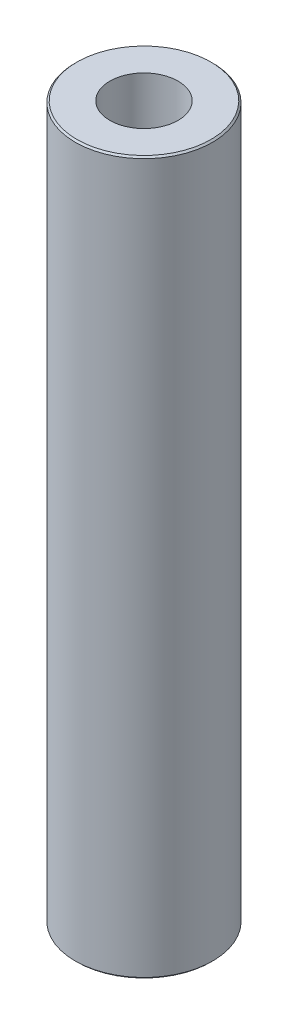
ISO-10303-21;
HEADER;
FILE_DESCRIPTION(('STEP AP214'),'2;1');
FILE_NAME('part.step','',(''),(''),'','','');
FILE_SCHEMA(('AUTOMOTIVE_DESIGN { 1 0 10303 214 1 1 1 1 }'));
ENDSEC;
DATA;
#1=APPLICATION_CONTEXT('core data for automotive mechanical design processes');
#2=APPLICATION_PROTOCOL_DEFINITION('international standard','automotive_design',2000,#1);
#3=PRODUCT_CONTEXT('',#1,'mechanical');
#4=PRODUCT('Part','Part','',(#3));
#5=PRODUCT_RELATED_PRODUCT_CATEGORY('part','',(#4));
#6=PRODUCT_DEFINITION_FORMATION('','',#4);
#7=PRODUCT_DEFINITION_CONTEXT('part definition',#1,'design');
#8=PRODUCT_DEFINITION('design','',#6,#7);
#9=PRODUCT_DEFINITION_SHAPE('','',#8);
#10=(LENGTH_UNIT() NAMED_UNIT(*) SI_UNIT(.MILLI.,.METRE.));
#11=(NAMED_UNIT(*) PLANE_ANGLE_UNIT() SI_UNIT($,.RADIAN.));
#12=(NAMED_UNIT(*) SI_UNIT($,.STERADIAN.) SOLID_ANGLE_UNIT());
#13=UNCERTAINTY_MEASURE_WITH_UNIT(LENGTH_MEASURE(1.E-05),#10,'distance_accuracy_value','');
#14=(GEOMETRIC_REPRESENTATION_CONTEXT(3) GLOBAL_UNCERTAINTY_ASSIGNED_CONTEXT((#13)) GLOBAL_UNIT_ASSIGNED_CONTEXT((#10,
#11,#12)) REPRESENTATION_CONTEXT('',''));
#15=CARTESIAN_POINT('',(0.,0.,0.));
#16=DIRECTION('',(0.,0.,1.));
#17=DIRECTION('',(1.,0.,0.));
#18=AXIS2_PLACEMENT_3D('',#15,#16,#17);
#19=CARTESIAN_POINT('',(0.,570.362885615048,0.));
#20=DIRECTION('',(0.,-1.,0.));
#21=DIRECTION('',(0.,0.,-1.));
#22=AXIS2_PLACEMENT_3D('',#19,#20,#21);
#23=CYLINDRICAL_SURFACE('',#22,55.);
#24=CARTESIAN_POINT('',(0.,569.061995954514,0.));
#25=DIRECTION('',(0.,1.,0.));
#26=DIRECTION('',(0.,0.,1.));
#27=AXIS2_PLACEMENT_3D('',#24,#25,#26);
#28=CIRCLE('',#27,55.);
#29=CARTESIAN_POINT('',(0.,569.061995954514,55.));
#30=VERTEX_POINT('',#29);
#31=EDGE_CURVE('E50',#30,#30,#28,.F.);
#32=ORIENTED_EDGE('',*,*,#31,.T.);
#33=EDGE_LOOP('',(#32));
#34=FACE_BOUND('',#33,.T.);
#35=CARTESIAN_POINT('',(0.,1.30088966053421,0.));
#36=DIRECTION('',(0.,1.,0.));
#37=DIRECTION('',(0.,0.,1.));
#38=AXIS2_PLACEMENT_3D('',#35,#36,#37);
#39=CIRCLE('',#38,55.);
#40=CARTESIAN_POINT('',(0.,1.30088966053421,55.));
#41=VERTEX_POINT('',#40);
#42=EDGE_CURVE('E51',#41,#41,#39,.T.);
#43=ORIENTED_EDGE('',*,*,#42,.T.);
#44=EDGE_LOOP('',(#43));
#45=FACE_BOUND('',#44,.T.);
#46=ADVANCED_FACE('F39',(#34,#45),#23,.T.);
#47=CARTESIAN_POINT('',(0.,570.362885615048,0.));
#48=DIRECTION('',(0.,1.,0.));
#49=DIRECTION('',(0.,0.,1.));
#50=AXIS2_PLACEMENT_3D('',#47,#48,#49);
#51=PLANE('',#50);
#52=CARTESIAN_POINT('',(0.,570.362885615048,0.));
#53=DIRECTION('',(0.,1.,0.));
#54=DIRECTION('',(0.,0.,1.));
#55=AXIS2_PLACEMENT_3D('',#52,#53,#54);
#56=CIRCLE('',#55,53.6991103394658);
#57=CARTESIAN_POINT('',(0.,570.362885615048,53.6991103394658));
#58=VERTEX_POINT('',#57);
#59=EDGE_CURVE('E54',#58,#58,#56,.T.);
#60=ORIENTED_EDGE('',*,*,#59,.T.);
#61=EDGE_LOOP('',(#60));
#62=FACE_BOUND('',#61,.T.);
#63=CARTESIAN_POINT('',(0.,570.362885615048,0.));
#64=DIRECTION('',(0.,1.,0.));
#65=DIRECTION('',(0.,0.,1.));
#66=AXIS2_PLACEMENT_3D('',#63,#64,#65);
#67=CIRCLE('',#66,27.3058281505517);
#68=CARTESIAN_POINT('',(0.,570.362885615048,27.3058281505517));
#69=VERTEX_POINT('',#68);
#70=EDGE_CURVE('E58',#69,#69,#67,.T.);
#71=ORIENTED_EDGE('',*,*,#70,.F.);
#72=EDGE_LOOP('',(#71));
#73=FACE_BOUND('',#72,.T.);
#74=ADVANCED_FACE('F69',(#62,#73),#51,.T.);
#75=CARTESIAN_POINT('',(0.,0.,0.));
#76=DIRECTION('',(0.,1.,0.));
#77=DIRECTION('',(0.,0.,1.));
#78=AXIS2_PLACEMENT_3D('',#75,#76,#77);
#79=PLANE('',#78);
#80=CARTESIAN_POINT('',(0.,0.,0.));
#81=DIRECTION('',(0.,1.,0.));
#82=DIRECTION('',(0.,0.,1.));
#83=AXIS2_PLACEMENT_3D('',#80,#81,#82);
#84=CIRCLE('',#83,53.6991103394657);
#85=CARTESIAN_POINT('',(0.,0.,53.6991103394657));
#86=VERTEX_POINT('',#85);
#87=EDGE_CURVE('E10',#86,#86,#84,.F.);
#88=ORIENTED_EDGE('',*,*,#87,.T.);
#89=EDGE_LOOP('',(#88));
#90=FACE_BOUND('',#89,.T.);
#91=CARTESIAN_POINT('',(0.,0.,0.));
#92=DIRECTION('',(0.,1.,0.));
#93=DIRECTION('',(0.,0.,1.));
#94=AXIS2_PLACEMENT_3D('',#91,#92,#93);
#95=CIRCLE('',#94,27.3058281505517);
#96=CARTESIAN_POINT('',(0.,0.,27.3058281505517));
#97=VERTEX_POINT('',#96);
#98=EDGE_CURVE('E63',#97,#97,#95,.T.);
#99=ORIENTED_EDGE('',*,*,#98,.T.);
#100=EDGE_LOOP('',(#99));
#101=FACE_BOUND('',#100,.T.);
#102=ADVANCED_FACE('F75',(#90,#101),#79,.F.);
#103=CARTESIAN_POINT('',(0.,570.362885615048,0.));
#104=DIRECTION('',(0.,-1.,0.));
#105=DIRECTION('',(0.,0.,-1.));
#106=AXIS2_PLACEMENT_3D('',#103,#104,#105);
#107=CYLINDRICAL_SURFACE('',#106,27.3058281505517);
#108=ORIENTED_EDGE('',*,*,#70,.T.);
#109=EDGE_LOOP('',(#108));
#110=FACE_BOUND('',#109,.T.);
#111=ORIENTED_EDGE('',*,*,#98,.F.);
#112=EDGE_LOOP('',(#111));
#113=FACE_BOUND('',#112,.T.);
#114=ADVANCED_FACE('F70',(#110,#113),#107,.F.);
#115=CARTESIAN_POINT('',(0.,570.362885615048,0.));
#116=DIRECTION('',(0.,-1.,0.));
#117=DIRECTION('',(0.,0.,-1.));
#118=AXIS2_PLACEMENT_3D('',#115,#116,#117);
#119=CONICAL_SURFACE('',#118,53.6991103394658,0.785398163397448);
#120=ORIENTED_EDGE('',*,*,#31,.F.);
#121=EDGE_LOOP('',(#120));
#122=FACE_BOUND('',#121,.T.);
#123=ORIENTED_EDGE('',*,*,#59,.F.);
#124=EDGE_LOOP('',(#123));
#125=FACE_BOUND('',#124,.T.);
#126=ADVANCED_FACE('F81',(#122,#125),#119,.T.);
#127=CARTESIAN_POINT('',(0.,1.30088966053421,0.));
#128=DIRECTION('',(0.,1.,0.));
#129=DIRECTION('',(0.,0.,1.));
#130=AXIS2_PLACEMENT_3D('',#127,#128,#129);
#131=CONICAL_SURFACE('',#130,55.,0.785398163397472);
#132=ORIENTED_EDGE('',*,*,#87,.F.);
#133=EDGE_LOOP('',(#132));
#134=FACE_BOUND('',#133,.T.);
#135=ORIENTED_EDGE('',*,*,#42,.F.);
#136=EDGE_LOOP('',(#135));
#137=FACE_BOUND('',#136,.T.);
#138=ADVANCED_FACE('F45',(#134,#137),#131,.T.);
#139=CLOSED_SHELL('',(#46,#74,#102,#114,#126,#138));
#140=MANIFOLD_SOLID_BREP('B2',#139);
#141=ADVANCED_BREP_SHAPE_REPRESENTATION('',(#18,#140),#14);
#142=SHAPE_DEFINITION_REPRESENTATION(#9,#141);
ENDSEC;
END-ISO-10303-21;
